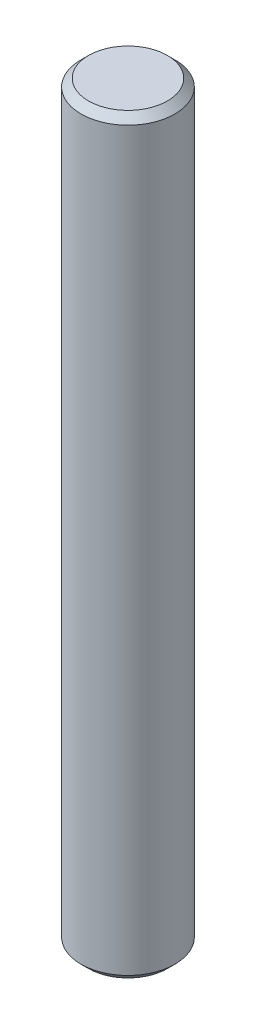
ISO-10303-21;
HEADER;
FILE_DESCRIPTION(('STEP AP214'),'2;1');
FILE_NAME('part.step','',(''),(''),'','','');
FILE_SCHEMA(('AUTOMOTIVE_DESIGN { 1 0 10303 214 1 1 1 1 }'));
ENDSEC;
DATA;
#1=APPLICATION_CONTEXT('core data for automotive mechanical design processes');
#2=APPLICATION_PROTOCOL_DEFINITION('international standard','automotive_design',2000,#1);
#3=PRODUCT_CONTEXT('',#1,'mechanical');
#4=PRODUCT('Part','Part','',(#3));
#5=PRODUCT_RELATED_PRODUCT_CATEGORY('part','',(#4));
#6=PRODUCT_DEFINITION_FORMATION('','',#4);
#7=PRODUCT_DEFINITION_CONTEXT('part definition',#1,'design');
#8=PRODUCT_DEFINITION('design','',#6,#7);
#9=PRODUCT_DEFINITION_SHAPE('','',#8);
#10=(LENGTH_UNIT() NAMED_UNIT(*) SI_UNIT(.MILLI.,.METRE.));
#11=(NAMED_UNIT(*) PLANE_ANGLE_UNIT() SI_UNIT($,.RADIAN.));
#12=(NAMED_UNIT(*) SI_UNIT($,.STERADIAN.) SOLID_ANGLE_UNIT());
#13=UNCERTAINTY_MEASURE_WITH_UNIT(LENGTH_MEASURE(1.E-05),#10,'distance_accuracy_value','');
#14=(GEOMETRIC_REPRESENTATION_CONTEXT(3) GLOBAL_UNCERTAINTY_ASSIGNED_CONTEXT((#13)) GLOBAL_UNIT_ASSIGNED_CONTEXT((#10,
#11,#12)) REPRESENTATION_CONTEXT('',''));
#15=CARTESIAN_POINT('',(0.,0.,0.));
#16=DIRECTION('',(0.,0.,1.));
#17=DIRECTION('',(1.,0.,0.));
#18=AXIS2_PLACEMENT_3D('',#15,#16,#17);
#19=CARTESIAN_POINT('',(0.,100.,0.));
#20=DIRECTION('',(0.,-1.,0.));
#21=DIRECTION('',(0.,0.,-1.));
#22=AXIS2_PLACEMENT_3D('',#19,#20,#21);
#23=CYLINDRICAL_SURFACE('',#22,12.5);
#24=CARTESIAN_POINT('',(0.,98.,0.));
#25=DIRECTION('',(0.,1.,0.));
#26=DIRECTION('',(0.,0.,1.));
#27=AXIS2_PLACEMENT_3D('',#24,#25,#26);
#28=CIRCLE('',#27,12.5);
#29=CARTESIAN_POINT('',(0.,98.,12.5));
#30=VERTEX_POINT('',#29);
#31=EDGE_CURVE('E38',#30,#30,#28,.F.);
#32=ORIENTED_EDGE('',*,*,#31,.T.);
#33=EDGE_LOOP('',(#32));
#34=FACE_BOUND('',#33,.T.);
#35=CARTESIAN_POINT('',(0.,-98.0000000000001,0.));
#36=DIRECTION('',(0.,1.,0.));
#37=DIRECTION('',(0.,0.,1.));
#38=AXIS2_PLACEMENT_3D('',#35,#36,#37);
#39=CIRCLE('',#38,12.5);
#40=CARTESIAN_POINT('',(0.,-98.0000000000001,12.5));
#41=VERTEX_POINT('',#40);
#42=EDGE_CURVE('E42',#41,#41,#39,.T.);
#43=ORIENTED_EDGE('',*,*,#42,.T.);
#44=EDGE_LOOP('',(#43));
#45=FACE_BOUND('',#44,.T.);
#46=ADVANCED_FACE('F31',(#34,#45),#23,.T.);
#47=CARTESIAN_POINT('',(0.,100.,0.));
#48=DIRECTION('',(0.,1.,0.));
#49=DIRECTION('',(0.,0.,1.));
#50=AXIS2_PLACEMENT_3D('',#47,#48,#49);
#51=PLANE('',#50);
#52=CARTESIAN_POINT('',(0.,100.,0.));
#53=DIRECTION('',(0.,1.,0.));
#54=DIRECTION('',(0.,0.,1.));
#55=AXIS2_PLACEMENT_3D('',#52,#53,#54);
#56=CIRCLE('',#55,10.5);
#57=CARTESIAN_POINT('',(0.,100.,10.5));
#58=VERTEX_POINT('',#57);
#59=EDGE_CURVE('E46',#58,#58,#56,.T.);
#60=ORIENTED_EDGE('',*,*,#59,.T.);
#61=EDGE_LOOP('',(#60));
#62=FACE_BOUND('',#61,.T.);
#63=ADVANCED_FACE('F52',(#62),#51,.T.);
#64=CARTESIAN_POINT('',(0.,-100.,0.));
#65=DIRECTION('',(0.,1.,0.));
#66=DIRECTION('',(0.,0.,1.));
#67=AXIS2_PLACEMENT_3D('',#64,#65,#66);
#68=PLANE('',#67);
#69=CARTESIAN_POINT('',(0.,-100.,0.));
#70=DIRECTION('',(0.,1.,0.));
#71=DIRECTION('',(0.,0.,1.));
#72=AXIS2_PLACEMENT_3D('',#69,#70,#71);
#73=CIRCLE('',#72,10.5);
#74=CARTESIAN_POINT('',(0.,-100.,10.5));
#75=VERTEX_POINT('',#74);
#76=EDGE_CURVE('E10',#75,#75,#73,.F.);
#77=ORIENTED_EDGE('',*,*,#76,.T.);
#78=EDGE_LOOP('',(#77));
#79=FACE_BOUND('',#78,.T.);
#80=ADVANCED_FACE('F56',(#79),#68,.F.);
#81=CARTESIAN_POINT('',(0.,100.,0.));
#82=DIRECTION('',(0.,-1.,0.));
#83=DIRECTION('',(0.,0.,-1.));
#84=AXIS2_PLACEMENT_3D('',#81,#82,#83);
#85=CONICAL_SURFACE('',#84,10.5,0.785398163397446);
#86=ORIENTED_EDGE('',*,*,#31,.F.);
#87=EDGE_LOOP('',(#86));
#88=FACE_BOUND('',#87,.T.);
#89=ORIENTED_EDGE('',*,*,#59,.F.);
#90=EDGE_LOOP('',(#89));
#91=FACE_BOUND('',#90,.T.);
#92=ADVANCED_FACE('F54',(#88,#91),#85,.T.);
#93=CARTESIAN_POINT('',(0.,-98.0000000000001,0.));
#94=DIRECTION('',(0.,1.,0.));
#95=DIRECTION('',(0.,0.,1.));
#96=AXIS2_PLACEMENT_3D('',#93,#94,#95);
#97=CONICAL_SURFACE('',#96,12.5,0.78539816339746);
#98=ORIENTED_EDGE('',*,*,#76,.F.);
#99=EDGE_LOOP('',(#98));
#100=FACE_BOUND('',#99,.T.);
#101=ORIENTED_EDGE('',*,*,#42,.F.);
#102=EDGE_LOOP('',(#101));
#103=FACE_BOUND('',#102,.T.);
#104=ADVANCED_FACE('F33',(#100,#103),#97,.T.);
#105=CLOSED_SHELL('',(#46,#63,#80,#92,#104));
#106=MANIFOLD_SOLID_BREP('B2',#105);
#107=ADVANCED_BREP_SHAPE_REPRESENTATION('',(#18,#106),#14);
#108=SHAPE_DEFINITION_REPRESENTATION(#9,#107);
ENDSEC;
END-ISO-10303-21;
